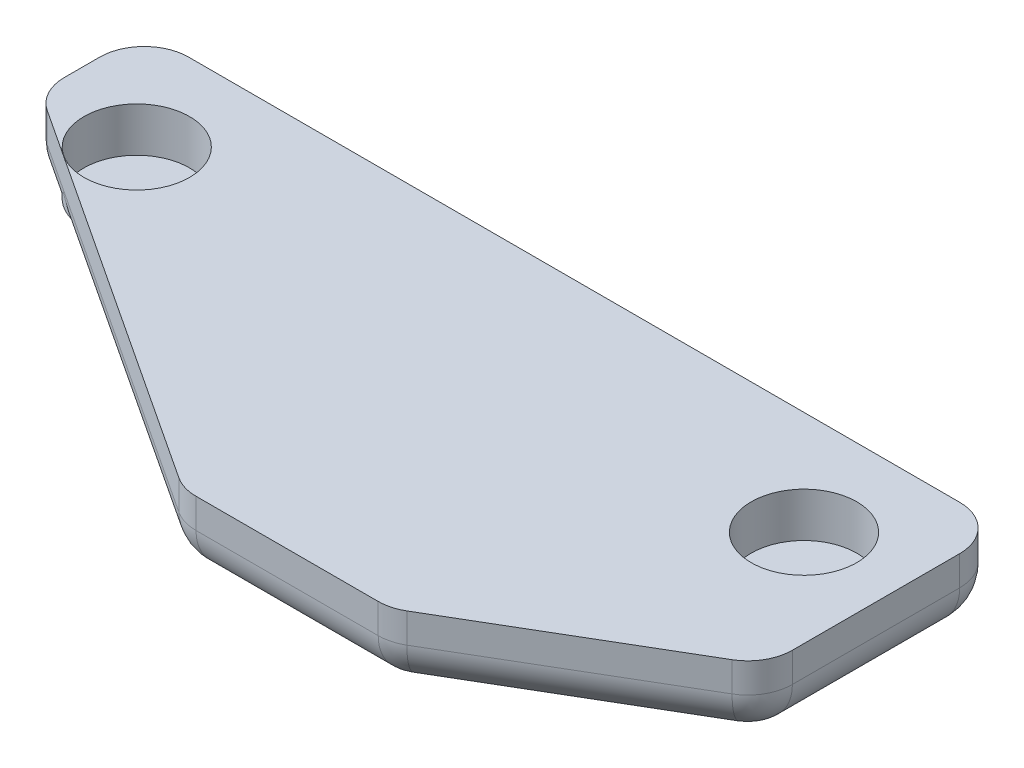
ISO-10303-21;
HEADER;
FILE_DESCRIPTION(('STEP AP214'),'2;1');
FILE_NAME('part.step','',(''),(''),'','','');
FILE_SCHEMA(('AUTOMOTIVE_DESIGN { 1 0 10303 214 1 1 1 1 }'));
ENDSEC;
DATA;
#1=APPLICATION_CONTEXT('core data for automotive mechanical design processes');
#2=APPLICATION_PROTOCOL_DEFINITION('international standard','automotive_design',2000,#1);
#3=PRODUCT_CONTEXT('',#1,'mechanical');
#4=PRODUCT('Part','Part','',(#3));
#5=PRODUCT_RELATED_PRODUCT_CATEGORY('part','',(#4));
#6=PRODUCT_DEFINITION_FORMATION('','',#4);
#7=PRODUCT_DEFINITION_CONTEXT('part definition',#1,'design');
#8=PRODUCT_DEFINITION('design','',#6,#7);
#9=PRODUCT_DEFINITION_SHAPE('','',#8);
#10=(LENGTH_UNIT() NAMED_UNIT(*) SI_UNIT(.MILLI.,.METRE.));
#11=(NAMED_UNIT(*) PLANE_ANGLE_UNIT() SI_UNIT($,.RADIAN.));
#12=(NAMED_UNIT(*) SI_UNIT($,.STERADIAN.) SOLID_ANGLE_UNIT());
#13=UNCERTAINTY_MEASURE_WITH_UNIT(LENGTH_MEASURE(1.E-05),#10,'distance_accuracy_value','');
#14=(GEOMETRIC_REPRESENTATION_CONTEXT(3) GLOBAL_UNCERTAINTY_ASSIGNED_CONTEXT((#13)) GLOBAL_UNIT_ASSIGNED_CONTEXT((#10,
#11,#12)) REPRESENTATION_CONTEXT('',''));
#15=CARTESIAN_POINT('',(0.,0.,0.));
#16=DIRECTION('',(0.,0.,1.));
#17=DIRECTION('',(1.,0.,0.));
#18=AXIS2_PLACEMENT_3D('',#15,#16,#17);
#19=CARTESIAN_POINT('',(-21.2161538362544,2.5,-11.7419034293701));
#20=DIRECTION('',(0.,0.,1.));
#21=DIRECTION('',(1.,0.,0.));
#22=AXIS2_PLACEMENT_3D('',#19,#20,#21);
#23=PLANE('',#22);
#24=DIRECTION('',(-1.,0.,0.));
#25=VECTOR('',#24,1.);
#26=CARTESIAN_POINT('',(-21.2161538362544,2.5,-11.7419034293701));
#27=LINE('',#26,#25);
#28=CARTESIAN_POINT('',(6.28384616374557,2.5,-11.7419034293701));
#29=VERTEX_POINT('',#28);
#30=CARTESIAN_POINT('',(-19.7161538362544,2.5,-11.7419034293701));
#31=VERTEX_POINT('',#30);
#32=EDGE_CURVE('E342',#29,#31,#27,.T.);
#33=ORIENTED_EDGE('',*,*,#32,.F.);
#34=DIRECTION('',(0.,-1.,0.));
#35=VECTOR('',#34,1.);
#36=CARTESIAN_POINT('',(6.28384616374558,2.5,-11.7419034293701));
#37=LINE('',#36,#35);
#38=CARTESIAN_POINT('',(6.28384616374558,1.5,-11.7419034293701));
#39=VERTEX_POINT('',#38);
#40=EDGE_CURVE('E11',#29,#39,#37,.T.);
#41=ORIENTED_EDGE('',*,*,#40,.T.);
#42=DIRECTION('',(-1.,0.,0.));
#43=VECTOR('',#42,1.);
#44=CARTESIAN_POINT('',(-21.2161538362544,1.5,-11.7419034293701));
#45=LINE('',#44,#43);
#46=CARTESIAN_POINT('',(-19.7161538362544,1.5,-11.7419034293701));
#47=VERTEX_POINT('',#46);
#48=EDGE_CURVE('E55',#39,#47,#45,.T.);
#49=ORIENTED_EDGE('',*,*,#48,.T.);
#50=DIRECTION('',(0.,-1.,0.));
#51=VECTOR('',#50,1.);
#52=CARTESIAN_POINT('',(-19.7161538362544,2.5,-11.7419034293701));
#53=LINE('',#52,#51);
#54=EDGE_CURVE('E254',#47,#31,#53,.F.);
#55=ORIENTED_EDGE('',*,*,#54,.T.);
#56=EDGE_LOOP('',(#33,#41,#49,#55));
#57=FACE_BOUND('',#56,.T.);
#58=ADVANCED_FACE('F45',(#57),#23,.F.);
#59=CARTESIAN_POINT('',(-21.2161538362544,2.5,-11.7419034293701));
#60=DIRECTION('',(1.,0.,0.));
#61=DIRECTION('',(0.,0.,-1.));
#62=AXIS2_PLACEMENT_3D('',#59,#60,#61);
#63=PLANE('',#62);
#64=DIRECTION('',(0.,0.,1.));
#65=VECTOR('',#64,1.);
#66=CARTESIAN_POINT('',(-21.2161538362544,1.5,-11.7419034293701));
#67=LINE('',#66,#65);
#68=CARTESIAN_POINT('',(-21.2161538362544,1.5,-10.2419034293701));
#69=VERTEX_POINT('',#68);
#70=CARTESIAN_POINT('',(-21.2161538362544,1.5,-9.05107985148774));
#71=VERTEX_POINT('',#70);
#72=EDGE_CURVE('E220',#69,#71,#67,.T.);
#73=ORIENTED_EDGE('',*,*,#72,.T.);
#74=DIRECTION('',(0.,-1.,0.));
#75=VECTOR('',#74,1.);
#76=CARTESIAN_POINT('',(-21.2161538362544,2.5,-9.05107985148774));
#77=LINE('',#76,#75);
#78=CARTESIAN_POINT('',(-21.2161538362544,2.5,-9.05107985148774));
#79=VERTEX_POINT('',#78);
#80=EDGE_CURVE('E223',#71,#79,#77,.F.);
#81=ORIENTED_EDGE('',*,*,#80,.T.);
#82=DIRECTION('',(0.,0.,1.));
#83=VECTOR('',#82,1.);
#84=CARTESIAN_POINT('',(-21.2161538362544,2.5,-11.7419034293701));
#85=LINE('',#84,#83);
#86=CARTESIAN_POINT('',(-21.2161538362544,2.5,-10.2419034293701));
#87=VERTEX_POINT('',#86);
#88=EDGE_CURVE('E346',#87,#79,#85,.T.);
#89=ORIENTED_EDGE('',*,*,#88,.F.);
#90=DIRECTION('',(0.,-1.,0.));
#91=VECTOR('',#90,1.);
#92=CARTESIAN_POINT('',(-21.2161538362544,2.5,-10.2419034293701));
#93=LINE('',#92,#91);
#94=EDGE_CURVE('E217',#87,#69,#93,.T.);
#95=ORIENTED_EDGE('',*,*,#94,.T.);
#96=EDGE_LOOP('',(#73,#81,#89,#95));
#97=FACE_BOUND('',#96,.T.);
#98=ADVANCED_FACE('F390',(#97),#63,.F.);
#99=CARTESIAN_POINT('',(-21.2161538362544,2.5,-8.24190342937014));
#100=DIRECTION('',(0.549177886660837,0.,-0.835705479701274));
#101=DIRECTION('',(-0.835705479701274,0.,-0.549177886660837));
#102=AXIS2_PLACEMENT_3D('',#99,#100,#101);
#103=PLANE('',#102);
#104=DIRECTION('',(0.835705479701274,0.,0.549177886660837));
#105=VECTOR('',#104,1.);
#106=CARTESIAN_POINT('',(-21.2161538362544,1.5,-8.24190342937014));
#107=LINE('',#106,#105);
#108=CARTESIAN_POINT('',(-20.5399206662457,1.5,-7.79752163193583));
#109=VERTEX_POINT('',#108);
#110=CARTESIAN_POINT('',(-7.59117393693629,1.5,0.711654790181765));
#111=VERTEX_POINT('',#110);
#112=EDGE_CURVE('E211',#109,#111,#107,.T.);
#113=ORIENTED_EDGE('',*,*,#112,.T.);
#114=DIRECTION('',(0.,-1.,0.));
#115=VECTOR('',#114,1.);
#116=CARTESIAN_POINT('',(-7.59117393693629,2.5,0.711654790181766));
#117=LINE('',#116,#115);
#118=CARTESIAN_POINT('',(-7.59117393693629,2.5,0.711654790181766));
#119=VERTEX_POINT('',#118);
#120=EDGE_CURVE('E214',#111,#119,#117,.F.);
#121=ORIENTED_EDGE('',*,*,#120,.T.);
#122=DIRECTION('',(0.835705479701274,0.,0.549177886660837));
#123=VECTOR('',#122,1.);
#124=CARTESIAN_POINT('',(-21.2161538362544,2.5,-8.24190342937014));
#125=LINE('',#124,#123);
#126=CARTESIAN_POINT('',(-20.5399206662457,2.5,-7.79752163193583));
#127=VERTEX_POINT('',#126);
#128=EDGE_CURVE('E351',#127,#119,#125,.T.);
#129=ORIENTED_EDGE('',*,*,#128,.F.);
#130=DIRECTION('',(0.,-1.,0.));
#131=VECTOR('',#130,1.);
#132=CARTESIAN_POINT('',(-20.5399206662457,2.5,-7.79752163193583));
#133=LINE('',#132,#131);
#134=EDGE_CURVE('E163',#127,#109,#133,.T.);
#135=ORIENTED_EDGE('',*,*,#134,.T.);
#136=EDGE_LOOP('',(#113,#121,#129,#135));
#137=FACE_BOUND('',#136,.T.);
#138=ADVANCED_FACE('F395',(#137),#103,.F.);
#139=CARTESIAN_POINT('',(-7.21615383625441,2.5,0.958096570629853));
#140=DIRECTION('',(0.,0.,-1.));
#141=DIRECTION('',(-1.,0.,0.));
#142=AXIS2_PLACEMENT_3D('',#139,#140,#141);
#143=PLANE('',#142);
#144=DIRECTION('',(1.,0.,0.));
#145=VECTOR('',#144,1.);
#146=CARTESIAN_POINT('',(-7.21615383625441,1.5,0.958096570629853));
#147=LINE('',#146,#145);
#148=CARTESIAN_POINT('',(-6.76740710694503,1.5,0.958096570629853));
#149=VERTEX_POINT('',#148);
#150=CARTESIAN_POINT('',(-0.624176081385551,1.5,0.958096570629853));
#151=VERTEX_POINT('',#150);
#152=EDGE_CURVE('E180',#149,#151,#147,.T.);
#153=ORIENTED_EDGE('',*,*,#152,.T.);
#154=DIRECTION('',(0.,-1.,0.));
#155=VECTOR('',#154,1.);
#156=CARTESIAN_POINT('',(-0.624176081385552,2.5,0.958096570629853));
#157=LINE('',#156,#155);
#158=CARTESIAN_POINT('',(-0.624176081385552,2.5,0.958096570629853));
#159=VERTEX_POINT('',#158);
#160=EDGE_CURVE('E192',#151,#159,#157,.F.);
#161=ORIENTED_EDGE('',*,*,#160,.T.);
#162=DIRECTION('',(1.,0.,0.));
#163=VECTOR('',#162,1.);
#164=CARTESIAN_POINT('',(-7.21615383625441,2.5,0.958096570629853));
#165=LINE('',#164,#163);
#166=CARTESIAN_POINT('',(-6.76740710694503,2.5,0.958096570629853));
#167=VERTEX_POINT('',#166);
#168=EDGE_CURVE('E158',#167,#159,#165,.T.);
#169=ORIENTED_EDGE('',*,*,#168,.F.);
#170=DIRECTION('',(0.,-1.,0.));
#171=VECTOR('',#170,1.);
#172=CARTESIAN_POINT('',(-6.76740710694503,2.5,0.958096570629853));
#173=LINE('',#172,#171);
#174=EDGE_CURVE('E185',#167,#149,#173,.T.);
#175=ORIENTED_EDGE('',*,*,#174,.T.);
#176=EDGE_LOOP('',(#153,#161,#169,#175));
#177=FACE_BOUND('',#176,.T.);
#178=ADVANCED_FACE('F491',(#177),#143,.F.);
#179=CARTESIAN_POINT('',(-0.216153836254414,2.5,0.958096570629853));
#180=DIRECTION('',(-0.506549048630866,0.,-0.862211146605729));
#181=DIRECTION('',(-0.862211146605729,0.,0.506549048630866));
#182=AXIS2_PLACEMENT_3D('',#179,#180,#181);
#183=PLANE('',#182);
#184=DIRECTION('',(0.862211146605728,0.,-0.506549048630866));
#185=VECTOR('',#184,1.);
#186=CARTESIAN_POINT('',(-0.216153836254414,2.5,0.958096570629853));
#187=LINE('',#186,#185);
#188=CARTESIAN_POINT('',(0.135647491560747,2.5,0.751413290538446));
#189=VERTEX_POINT('',#188);
#190=CARTESIAN_POINT('',(7.04366973669188,2.5,-3.3070497784761));
#191=VERTEX_POINT('',#190);
#192=EDGE_CURVE('E155',#189,#191,#187,.T.);
#193=ORIENTED_EDGE('',*,*,#192,.F.);
#194=DIRECTION('',(0.,-1.,0.));
#195=VECTOR('',#194,1.);
#196=CARTESIAN_POINT('',(0.135647491560747,2.5,0.751413290538446));
#197=LINE('',#196,#195);
#198=CARTESIAN_POINT('',(0.135647491560747,1.5,0.751413290538446));
#199=VERTEX_POINT('',#198);
#200=EDGE_CURVE('E169',#189,#199,#197,.T.);
#201=ORIENTED_EDGE('',*,*,#200,.T.);
#202=DIRECTION('',(0.862211146605729,0.,-0.506549048630866));
#203=VECTOR('',#202,1.);
#204=CARTESIAN_POINT('',(-0.216153836254414,1.5,0.958096570629853));
#205=LINE('',#204,#203);
#206=CARTESIAN_POINT('',(7.04366973669188,1.5,-3.3070497784761));
#207=VERTEX_POINT('',#206);
#208=EDGE_CURVE('E181',#199,#207,#205,.T.);
#209=ORIENTED_EDGE('',*,*,#208,.T.);
#210=DIRECTION('',(0.,-1.,0.));
#211=VECTOR('',#210,1.);
#212=CARTESIAN_POINT('',(7.04366973669188,2.5,-3.3070497784761));
#213=LINE('',#212,#211);
#214=EDGE_CURVE('E171',#207,#191,#213,.F.);
#215=ORIENTED_EDGE('',*,*,#214,.T.);
#216=EDGE_LOOP('',(#193,#201,#209,#215));
#217=FACE_BOUND('',#216,.T.);
#218=ADVANCED_FACE('F168',(#217),#183,.F.);
#219=CARTESIAN_POINT('',(7.78384616374558,2.5,-3.74190342937014));
#220=DIRECTION('',(-1.,0.,0.));
#221=DIRECTION('',(0.,0.,1.));
#222=AXIS2_PLACEMENT_3D('',#219,#220,#221);
#223=PLANE('',#222);
#224=DIRECTION('',(0.,0.,-1.));
#225=VECTOR('',#224,1.);
#226=CARTESIAN_POINT('',(7.78384616374558,2.5,-3.74190342937014));
#227=LINE('',#226,#225);
#228=CARTESIAN_POINT('',(7.78384616374558,2.5,-4.60036649838469));
#229=VERTEX_POINT('',#228);
#230=CARTESIAN_POINT('',(7.78384616374558,2.5,-10.2419034293701));
#231=VERTEX_POINT('',#230);
#232=EDGE_CURVE('E173',#229,#231,#227,.T.);
#233=ORIENTED_EDGE('',*,*,#232,.F.);
#234=DIRECTION('',(0.,-1.,0.));
#235=VECTOR('',#234,1.);
#236=CARTESIAN_POINT('',(7.78384616374558,2.5,-4.60036649838469));
#237=LINE('',#236,#235);
#238=CARTESIAN_POINT('',(7.78384616374558,1.5,-4.60036649838469));
#239=VERTEX_POINT('',#238);
#240=EDGE_CURVE('E251',#229,#239,#237,.T.);
#241=ORIENTED_EDGE('',*,*,#240,.T.);
#242=DIRECTION('',(0.,0.,-1.));
#243=VECTOR('',#242,1.);
#244=CARTESIAN_POINT('',(7.78384616374558,1.5,-3.74190342937014));
#245=LINE('',#244,#243);
#246=CARTESIAN_POINT('',(7.78384616374558,1.5,-10.2419034293701));
#247=VERTEX_POINT('',#246);
#248=EDGE_CURVE('E248',#239,#247,#245,.T.);
#249=ORIENTED_EDGE('',*,*,#248,.T.);
#250=DIRECTION('',(0.,-1.,0.));
#251=VECTOR('',#250,1.);
#252=CARTESIAN_POINT('',(7.78384616374558,2.5,-10.2419034293701));
#253=LINE('',#252,#251);
#254=EDGE_CURVE('E245',#247,#231,#253,.F.);
#255=ORIENTED_EDGE('',*,*,#254,.T.);
#256=EDGE_LOOP('',(#233,#241,#249,#255));
#257=FACE_BOUND('',#256,.T.);
#258=ADVANCED_FACE('F372',(#257),#223,.F.);
#259=CARTESIAN_POINT('',(0.,2.5,0.));
#260=DIRECTION('',(0.,1.,0.));
#261=DIRECTION('',(0.,0.,1.));
#262=AXIS2_PLACEMENT_3D('',#259,#260,#261);
#263=PLANE('',#262);
#264=CARTESIAN_POINT('',(-17.9661538362544,2.5,-8.24190342937014));
#265=DIRECTION('',(0.,1.,0.));
#266=DIRECTION('',(0.,0.,1.));
#267=AXIS2_PLACEMENT_3D('',#264,#265,#266);
#268=CIRCLE('',#267,1.78);
#269=CARTESIAN_POINT('',(-17.9661538362544,2.5,-6.46190342937014));
#270=VERTEX_POINT('',#269);
#271=EDGE_CURVE('E338',#270,#270,#268,.T.);
#272=ORIENTED_EDGE('',*,*,#271,.F.);
#273=EDGE_LOOP('',(#272));
#274=FACE_BOUND('',#273,.T.);
#275=CARTESIAN_POINT('',(4.53384616374558,2.5,-8.24190342937014));
#276=DIRECTION('',(0.,1.,0.));
#277=DIRECTION('',(0.,0.,-1.));
#278=AXIS2_PLACEMENT_3D('',#275,#276,#277);
#279=CIRCLE('',#278,1.78);
#280=CARTESIAN_POINT('',(4.53384616374558,2.5,-10.0219034293701));
#281=VERTEX_POINT('',#280);
#282=EDGE_CURVE('E332',#281,#281,#279,.T.);
#283=ORIENTED_EDGE('',*,*,#282,.F.);
#284=EDGE_LOOP('',(#283));
#285=FACE_BOUND('',#284,.T.);
#286=ORIENTED_EDGE('',*,*,#168,.T.);
#287=CARTESIAN_POINT('',(-0.624176081385551,2.5,-0.541903429370147));
#288=DIRECTION('',(0.,1.,0.));
#289=DIRECTION('',(0.,0.,1.));
#290=AXIS2_PLACEMENT_3D('',#287,#288,#289);
#291=CIRCLE('',#290,1.5);
#292=EDGE_CURVE('E152',#159,#189,#291,.T.);
#293=ORIENTED_EDGE('',*,*,#292,.T.);
#294=ORIENTED_EDGE('',*,*,#192,.T.);
#295=CARTESIAN_POINT('',(6.28384616374558,2.5,-4.60036649838469));
#296=DIRECTION('',(0.,1.,0.));
#297=DIRECTION('',(0.,0.,1.));
#298=AXIS2_PLACEMENT_3D('',#295,#296,#297);
#299=CIRCLE('',#298,1.5);
#300=EDGE_CURVE('E204',#191,#229,#299,.T.);
#301=ORIENTED_EDGE('',*,*,#300,.T.);
#302=ORIENTED_EDGE('',*,*,#232,.T.);
#303=CARTESIAN_POINT('',(6.28384616374558,2.5,-10.2419034293701));
#304=DIRECTION('',(0.,1.,0.));
#305=DIRECTION('',(0.,0.,1.));
#306=AXIS2_PLACEMENT_3D('',#303,#304,#305);
#307=CIRCLE('',#306,1.5);
#308=EDGE_CURVE('E201',#231,#29,#307,.T.);
#309=ORIENTED_EDGE('',*,*,#308,.T.);
#310=ORIENTED_EDGE('',*,*,#32,.T.);
#311=CARTESIAN_POINT('',(-19.7161538362544,2.5,-10.2419034293701));
#312=DIRECTION('',(0.,1.,0.));
#313=DIRECTION('',(0.,0.,1.));
#314=AXIS2_PLACEMENT_3D('',#311,#312,#313);
#315=CIRCLE('',#314,1.5);
#316=EDGE_CURVE('E195',#31,#87,#315,.T.);
#317=ORIENTED_EDGE('',*,*,#316,.T.);
#318=ORIENTED_EDGE('',*,*,#88,.T.);
#319=CARTESIAN_POINT('',(-19.7161538362544,2.5,-9.05107985148774));
#320=DIRECTION('',(0.,1.,0.));
#321=DIRECTION('',(0.,0.,1.));
#322=AXIS2_PLACEMENT_3D('',#319,#320,#321);
#323=CIRCLE('',#322,1.5);
#324=EDGE_CURVE('E198',#79,#127,#323,.T.);
#325=ORIENTED_EDGE('',*,*,#324,.T.);
#326=ORIENTED_EDGE('',*,*,#128,.T.);
#327=CARTESIAN_POINT('',(-6.76740710694503,2.5,-0.541903429370147));
#328=DIRECTION('',(0.,1.,0.));
#329=DIRECTION('',(0.,0.,1.));
#330=AXIS2_PLACEMENT_3D('',#327,#328,#329);
#331=CIRCLE('',#330,1.5);
#332=EDGE_CURVE('E164',#119,#167,#331,.T.);
#333=ORIENTED_EDGE('',*,*,#332,.T.);
#334=EDGE_LOOP('',(#286,#293,#294,#301,#302,#309,#310,#317,#318,#325,#326,#333));
#335=FACE_BOUND('',#334,.T.);
#336=ADVANCED_FACE('F154',(#274,#285,#335),#263,.T.);
#337=CARTESIAN_POINT('',(0.,0.,0.));
#338=DIRECTION('',(0.,1.,0.));
#339=DIRECTION('',(0.,0.,1.));
#340=AXIS2_PLACEMENT_3D('',#337,#338,#339);
#341=PLANE('',#340);
#342=DIRECTION('',(0.835705479701274,0.,0.549177886660837));
#343=VECTOR('',#342,1.);
#344=CARTESIAN_POINT('',(-1.79231818639165,0.,2.72744071842207));
#345=LINE('',#344,#343);
#346=CARTESIAN_POINT('',(-6.76740710694503,0.,-0.541903429370147));
#347=VERTEX_POINT('',#346);
#348=CARTESIAN_POINT('',(-19.7161538362544,0.,-9.05107985148774));
#349=VERTEX_POINT('',#348);
#350=EDGE_CURVE('E238',#347,#349,#345,.F.);
#351=ORIENTED_EDGE('',*,*,#350,.T.);
#352=DIRECTION('',(0.,0.,1.));
#353=VECTOR('',#352,1.);
#354=CARTESIAN_POINT('',(-19.7161538362544,0.,0.));
#355=LINE('',#354,#353);
#356=CARTESIAN_POINT('',(-19.7161538362544,0.,-10.2419034293701));
#357=VERTEX_POINT('',#356);
#358=EDGE_CURVE('E241',#349,#357,#355,.F.);
#359=ORIENTED_EDGE('',*,*,#358,.T.);
#360=DIRECTION('',(-1.,0.,0.));
#361=VECTOR('',#360,1.);
#362=CARTESIAN_POINT('',(0.,0.,-10.2419034293701));
#363=LINE('',#362,#361);
#364=CARTESIAN_POINT('',(6.28384616374558,0.,-10.2419034293701));
#365=VERTEX_POINT('',#364);
#366=EDGE_CURVE('E226',#357,#365,#363,.F.);
#367=ORIENTED_EDGE('',*,*,#366,.T.);
#368=DIRECTION('',(0.,0.,-1.));
#369=VECTOR('',#368,1.);
#370=CARTESIAN_POINT('',(6.28384616374558,0.,0.));
#371=LINE('',#370,#369);
#372=CARTESIAN_POINT('',(6.28384616374558,0.,-4.60036649838469));
#373=VERTEX_POINT('',#372);
#374=EDGE_CURVE('E229',#365,#373,#371,.F.);
#375=ORIENTED_EDGE('',*,*,#374,.T.);
#376=DIRECTION('',(0.862211146605729,0.,-0.506549048630866));
#377=VECTOR('',#376,1.);
#378=CARTESIAN_POINT('',(-0.396836085284288,0.,-0.675465677079639));
#379=LINE('',#378,#377);
#380=CARTESIAN_POINT('',(-0.624176081385551,0.,-0.541903429370147));
#381=VERTEX_POINT('',#380);
#382=EDGE_CURVE('E232',#373,#381,#379,.F.);
#383=ORIENTED_EDGE('',*,*,#382,.T.);
#384=DIRECTION('',(1.,0.,0.));
#385=VECTOR('',#384,1.);
#386=CARTESIAN_POINT('',(0.,0.,-0.541903429370147));
#387=LINE('',#386,#385);
#388=EDGE_CURVE('E235',#381,#347,#387,.F.);
#389=ORIENTED_EDGE('',*,*,#388,.T.);
#390=EDGE_LOOP('',(#351,#359,#367,#375,#383,#389));
#391=FACE_BOUND('',#390,.T.);
#392=ADVANCED_FACE('F371',(#391),#341,.F.);
#393=CARTESIAN_POINT('',(4.53384616374558,1.,-8.24190342937014));
#394=DIRECTION('',(0.,1.,0.));
#395=DIRECTION('',(0.,0.,1.));
#396=AXIS2_PLACEMENT_3D('',#393,#394,#395);
#397=CYLINDRICAL_SURFACE('',#396,1.78);
#398=CARTESIAN_POINT('',(4.53384616374558,1.,-8.24190342937014));
#399=DIRECTION('',(0.,1.,0.));
#400=DIRECTION('',(0.,0.,-1.));
#401=AXIS2_PLACEMENT_3D('',#398,#399,#400);
#402=CIRCLE('',#401,1.78);
#403=CARTESIAN_POINT('',(4.53384616374558,1.,-10.0219034293701));
#404=VERTEX_POINT('',#403);
#405=EDGE_CURVE('E326',#404,#404,#402,.T.);
#406=ORIENTED_EDGE('',*,*,#405,.F.);
#407=EDGE_LOOP('',(#406));
#408=FACE_BOUND('',#407,.T.);
#409=ORIENTED_EDGE('',*,*,#282,.T.);
#410=EDGE_LOOP('',(#409));
#411=FACE_BOUND('',#410,.T.);
#412=ADVANCED_FACE('F376',(#408,#411),#397,.F.);
#413=CARTESIAN_POINT('',(4.53384616374558,1.,-8.24190342937014));
#414=DIRECTION('',(0.,-1.,0.));
#415=DIRECTION('',(0.,0.,-1.));
#416=AXIS2_PLACEMENT_3D('',#413,#414,#415);
#417=PLANE('',#416);
#418=ORIENTED_EDGE('',*,*,#405,.T.);
#419=EDGE_LOOP('',(#418));
#420=FACE_BOUND('',#419,.T.);
#421=ADVANCED_FACE('F378',(#420),#417,.F.);
#422=CARTESIAN_POINT('',(-17.9661538362544,1.,-8.24190342937014));
#423=DIRECTION('',(0.,1.,0.));
#424=DIRECTION('',(0.,0.,1.));
#425=AXIS2_PLACEMENT_3D('',#422,#423,#424);
#426=CYLINDRICAL_SURFACE('',#425,1.78);
#427=CARTESIAN_POINT('',(-17.9661538362544,1.,-8.24190342937014));
#428=DIRECTION('',(0.,1.,0.));
#429=DIRECTION('',(0.,0.,1.));
#430=AXIS2_PLACEMENT_3D('',#427,#428,#429);
#431=CIRCLE('',#430,1.78);
#432=CARTESIAN_POINT('',(-17.9661538362544,1.,-6.46190342937014));
#433=VERTEX_POINT('',#432);
#434=EDGE_CURVE('E347',#433,#433,#431,.T.);
#435=ORIENTED_EDGE('',*,*,#434,.F.);
#436=EDGE_LOOP('',(#435));
#437=FACE_BOUND('',#436,.T.);
#438=ORIENTED_EDGE('',*,*,#271,.T.);
#439=EDGE_LOOP('',(#438));
#440=FACE_BOUND('',#439,.T.);
#441=ADVANCED_FACE('F367',(#437,#440),#426,.F.);
#442=CARTESIAN_POINT('',(-17.9661538362544,1.,-8.24190342937014));
#443=DIRECTION('',(0.,1.,0.));
#444=DIRECTION('',(0.,0.,1.));
#445=AXIS2_PLACEMENT_3D('',#442,#443,#444);
#446=PLANE('',#445);
#447=ORIENTED_EDGE('',*,*,#434,.T.);
#448=EDGE_LOOP('',(#447));
#449=FACE_BOUND('',#448,.T.);
#450=ADVANCED_FACE('F465',(#449),#446,.T.);
#451=CARTESIAN_POINT('',(-19.7161538362544,2.5,-10.2419034293701));
#452=DIRECTION('',(0.,-1.,0.));
#453=DIRECTION('',(0.,0.,-1.));
#454=AXIS2_PLACEMENT_3D('',#451,#452,#453);
#455=CYLINDRICAL_SURFACE('',#454,1.5);
#456=CARTESIAN_POINT('',(-19.7161538362544,1.5,-10.2419034293701));
#457=DIRECTION('',(0.,-1.,0.));
#458=DIRECTION('',(0.,0.,-1.));
#459=AXIS2_PLACEMENT_3D('',#456,#457,#458);
#460=CIRCLE('',#459,1.5);
#461=EDGE_CURVE('E49',#69,#47,#460,.T.);
#462=ORIENTED_EDGE('',*,*,#461,.F.);
#463=ORIENTED_EDGE('',*,*,#94,.F.);
#464=ORIENTED_EDGE('',*,*,#316,.F.);
#465=ORIENTED_EDGE('',*,*,#54,.F.);
#466=EDGE_LOOP('',(#462,#463,#464,#465));
#467=FACE_BOUND('',#466,.T.);
#468=ADVANCED_FACE('F47',(#467),#455,.T.);
#469=CARTESIAN_POINT('',(-19.7161538362544,1.5,-10.2419034293701));
#470=DIRECTION('',(0.,0.,-1.));
#471=DIRECTION('',(-1.,0.,0.));
#472=AXIS2_PLACEMENT_3D('',#469,#470,#471);
#473=SPHERICAL_SURFACE('',#472,1.5);
#474=CARTESIAN_POINT('',(-19.7161538362544,1.5,-10.2419034293701));
#475=DIRECTION('',(0.,0.,-1.));
#476=DIRECTION('',(-1.,0.,0.));
#477=AXIS2_PLACEMENT_3D('',#474,#475,#476);
#478=CIRCLE('',#477,1.5);
#479=EDGE_CURVE('E316',#69,#357,#478,.F.);
#480=ORIENTED_EDGE('',*,*,#479,.F.);
#481=ORIENTED_EDGE('',*,*,#461,.T.);
#482=CARTESIAN_POINT('',(-19.7161538362544,1.5,-10.2419034293701));
#483=DIRECTION('',(-1.,0.,0.));
#484=DIRECTION('',(0.,0.,1.));
#485=AXIS2_PLACEMENT_3D('',#482,#483,#484);
#486=CIRCLE('',#485,1.5);
#487=EDGE_CURVE('E319',#357,#47,#486,.F.);
#488=ORIENTED_EDGE('',*,*,#487,.F.);
#489=EDGE_LOOP('',(#480,#481,#488));
#490=FACE_BOUND('',#489,.T.);
#491=ADVANCED_FACE('F459',(#490),#473,.T.);
#492=CARTESIAN_POINT('',(6.28384616374558,2.5,-10.2419034293701));
#493=DIRECTION('',(0.,-1.,0.));
#494=DIRECTION('',(0.,0.,-1.));
#495=AXIS2_PLACEMENT_3D('',#492,#493,#494);
#496=CYLINDRICAL_SURFACE('',#495,1.5);
#497=ORIENTED_EDGE('',*,*,#308,.F.);
#498=ORIENTED_EDGE('',*,*,#254,.F.);
#499=CARTESIAN_POINT('',(6.28384616374558,1.5,-10.2419034293701));
#500=DIRECTION('',(0.,-1.,0.));
#501=DIRECTION('',(0.,0.,-1.));
#502=AXIS2_PLACEMENT_3D('',#499,#500,#501);
#503=CIRCLE('',#502,1.5);
#504=EDGE_CURVE('E312',#39,#247,#503,.T.);
#505=ORIENTED_EDGE('',*,*,#504,.F.);
#506=ORIENTED_EDGE('',*,*,#40,.F.);
#507=EDGE_LOOP('',(#497,#498,#505,#506));
#508=FACE_BOUND('',#507,.T.);
#509=ADVANCED_FACE('F457',(#508),#496,.T.);
#510=CARTESIAN_POINT('',(-21.2161538362544,1.5,-10.2419034293701));
#511=DIRECTION('',(-1.,0.,0.));
#512=DIRECTION('',(0.,0.,1.));
#513=AXIS2_PLACEMENT_3D('',#510,#511,#512);
#514=CYLINDRICAL_SURFACE('',#513,1.5);
#515=ORIENTED_EDGE('',*,*,#487,.T.);
#516=ORIENTED_EDGE('',*,*,#48,.F.);
#517=CARTESIAN_POINT('',(6.28384616374558,1.5,-10.2419034293701));
#518=DIRECTION('',(1.,0.,0.));
#519=DIRECTION('',(0.,0.,-1.));
#520=AXIS2_PLACEMENT_3D('',#517,#518,#519);
#521=CIRCLE('',#520,1.5);
#522=EDGE_CURVE('E308',#365,#39,#521,.T.);
#523=ORIENTED_EDGE('',*,*,#522,.F.);
#524=ORIENTED_EDGE('',*,*,#366,.F.);
#525=EDGE_LOOP('',(#515,#516,#523,#524));
#526=FACE_BOUND('',#525,.T.);
#527=ADVANCED_FACE('F453',(#526),#514,.T.);
#528=CARTESIAN_POINT('',(-19.7161538362544,1.5,-11.7419034293701));
#529=DIRECTION('',(0.,0.,1.));
#530=DIRECTION('',(1.,0.,0.));
#531=AXIS2_PLACEMENT_3D('',#528,#529,#530);
#532=CYLINDRICAL_SURFACE('',#531,1.5);
#533=ORIENTED_EDGE('',*,*,#479,.T.);
#534=ORIENTED_EDGE('',*,*,#358,.F.);
#535=CARTESIAN_POINT('',(-19.7161538362544,1.5,-9.05107985148774));
#536=DIRECTION('',(0.,0.,1.));
#537=DIRECTION('',(1.,0.,0.));
#538=AXIS2_PLACEMENT_3D('',#535,#536,#537);
#539=CIRCLE('',#538,1.5);
#540=EDGE_CURVE('E304',#71,#349,#539,.T.);
#541=ORIENTED_EDGE('',*,*,#540,.F.);
#542=ORIENTED_EDGE('',*,*,#72,.F.);
#543=EDGE_LOOP('',(#533,#534,#541,#542));
#544=FACE_BOUND('',#543,.T.);
#545=ADVANCED_FACE('F449',(#544),#532,.T.);
#546=CARTESIAN_POINT('',(-19.7161538362544,2.5,-9.05107985148774));
#547=DIRECTION('',(0.,-1.,0.));
#548=DIRECTION('',(0.,0.,-1.));
#549=AXIS2_PLACEMENT_3D('',#546,#547,#548);
#550=CYLINDRICAL_SURFACE('',#549,1.5);
#551=ORIENTED_EDGE('',*,*,#324,.F.);
#552=ORIENTED_EDGE('',*,*,#80,.F.);
#553=CARTESIAN_POINT('',(-19.7161538362544,1.5,-9.05107985148774));
#554=DIRECTION('',(0.,-1.,0.));
#555=DIRECTION('',(0.,0.,-1.));
#556=AXIS2_PLACEMENT_3D('',#553,#554,#555);
#557=CIRCLE('',#556,1.5);
#558=EDGE_CURVE('E300',#109,#71,#557,.T.);
#559=ORIENTED_EDGE('',*,*,#558,.F.);
#560=ORIENTED_EDGE('',*,*,#134,.F.);
#561=EDGE_LOOP('',(#551,#552,#559,#560));
#562=FACE_BOUND('',#561,.T.);
#563=ADVANCED_FACE('F445',(#562),#550,.T.);
#564=CARTESIAN_POINT('',(6.28384616374558,1.5,-10.2419034293701));
#565=DIRECTION('',(0.,0.,-1.));
#566=DIRECTION('',(-1.,0.,0.));
#567=AXIS2_PLACEMENT_3D('',#564,#565,#566);
#568=SPHERICAL_SURFACE('',#567,1.5);
#569=ORIENTED_EDGE('',*,*,#522,.T.);
#570=ORIENTED_EDGE('',*,*,#504,.T.);
#571=CARTESIAN_POINT('',(6.28384616374558,1.5,-10.2419034293701));
#572=DIRECTION('',(0.,0.,-1.));
#573=DIRECTION('',(-1.,0.,0.));
#574=AXIS2_PLACEMENT_3D('',#571,#572,#573);
#575=CIRCLE('',#574,1.5);
#576=EDGE_CURVE('E296',#365,#247,#575,.F.);
#577=ORIENTED_EDGE('',*,*,#576,.F.);
#578=EDGE_LOOP('',(#569,#570,#577));
#579=FACE_BOUND('',#578,.T.);
#580=ADVANCED_FACE('F441',(#579),#568,.T.);
#581=CARTESIAN_POINT('',(-19.7161538362544,1.5,-9.05107985148774));
#582=DIRECTION('',(0.,-1.,0.));
#583=DIRECTION('',(0.,0.,-1.));
#584=AXIS2_PLACEMENT_3D('',#581,#582,#583);
#585=SPHERICAL_SURFACE('',#584,1.5);
#586=ORIENTED_EDGE('',*,*,#558,.T.);
#587=ORIENTED_EDGE('',*,*,#540,.T.);
#588=CARTESIAN_POINT('',(-19.7161538362544,1.5,-9.05107985148774));
#589=DIRECTION('',(-0.835705479701274,0.,-0.549177886660837));
#590=DIRECTION('',(-0.549177886660837,0.,0.835705479701274));
#591=AXIS2_PLACEMENT_3D('',#588,#589,#590);
#592=CIRCLE('',#591,1.5);
#593=EDGE_CURVE('E292',#109,#349,#592,.F.);
#594=ORIENTED_EDGE('',*,*,#593,.F.);
#595=EDGE_LOOP('',(#586,#587,#594));
#596=FACE_BOUND('',#595,.T.);
#597=ADVANCED_FACE('F437',(#596),#585,.T.);
#598=CARTESIAN_POINT('',(6.28384616374558,2.5,-4.60036649838469));
#599=DIRECTION('',(0.,-1.,0.));
#600=DIRECTION('',(0.,0.,-1.));
#601=AXIS2_PLACEMENT_3D('',#598,#599,#600);
#602=CYLINDRICAL_SURFACE('',#601,1.5);
#603=ORIENTED_EDGE('',*,*,#300,.F.);
#604=ORIENTED_EDGE('',*,*,#214,.F.);
#605=CARTESIAN_POINT('',(6.28384616374558,1.5,-4.60036649838469));
#606=DIRECTION('',(0.,-1.,0.));
#607=DIRECTION('',(0.,0.,-1.));
#608=AXIS2_PLACEMENT_3D('',#605,#606,#607);
#609=CIRCLE('',#608,1.5);
#610=EDGE_CURVE('E288',#239,#207,#609,.T.);
#611=ORIENTED_EDGE('',*,*,#610,.F.);
#612=ORIENTED_EDGE('',*,*,#240,.F.);
#613=EDGE_LOOP('',(#603,#604,#611,#612));
#614=FACE_BOUND('',#613,.T.);
#615=ADVANCED_FACE('F433',(#614),#602,.T.);
#616=CARTESIAN_POINT('',(6.28384616374558,1.5,-3.74190342937014));
#617=DIRECTION('',(0.,0.,-1.));
#618=DIRECTION('',(-1.,0.,0.));
#619=AXIS2_PLACEMENT_3D('',#616,#617,#618);
#620=CYLINDRICAL_SURFACE('',#619,1.5);
#621=ORIENTED_EDGE('',*,*,#576,.T.);
#622=ORIENTED_EDGE('',*,*,#248,.F.);
#623=CARTESIAN_POINT('',(6.28384616374558,1.5,-4.60036649838469));
#624=DIRECTION('',(0.,0.,1.));
#625=DIRECTION('',(1.,0.,0.));
#626=AXIS2_PLACEMENT_3D('',#623,#624,#625);
#627=CIRCLE('',#626,1.5);
#628=EDGE_CURVE('E284',#373,#239,#627,.T.);
#629=ORIENTED_EDGE('',*,*,#628,.F.);
#630=ORIENTED_EDGE('',*,*,#374,.F.);
#631=EDGE_LOOP('',(#621,#622,#629,#630));
#632=FACE_BOUND('',#631,.T.);
#633=ADVANCED_FACE('F429',(#632),#620,.T.);
#634=CARTESIAN_POINT('',(-20.3923870062632,1.5,-9.49546164892205));
#635=DIRECTION('',(0.835705479701274,0.,0.549177886660837));
#636=DIRECTION('',(0.549177886660837,0.,-0.835705479701274));
#637=AXIS2_PLACEMENT_3D('',#634,#635,#636);
#638=CYLINDRICAL_SURFACE('',#637,1.5);
#639=ORIENTED_EDGE('',*,*,#593,.T.);
#640=ORIENTED_EDGE('',*,*,#350,.F.);
#641=CARTESIAN_POINT('',(-6.76740710694503,1.5,-0.541903429370146));
#642=DIRECTION('',(0.835705479701274,0.,0.549177886660837));
#643=DIRECTION('',(0.549177886660837,0.,-0.835705479701274));
#644=AXIS2_PLACEMENT_3D('',#641,#642,#643);
#645=CIRCLE('',#644,1.5);
#646=EDGE_CURVE('E280',#111,#347,#645,.T.);
#647=ORIENTED_EDGE('',*,*,#646,.F.);
#648=ORIENTED_EDGE('',*,*,#112,.F.);
#649=EDGE_LOOP('',(#639,#640,#647,#648));
#650=FACE_BOUND('',#649,.T.);
#651=ADVANCED_FACE('F425',(#650),#638,.T.);
#652=CARTESIAN_POINT('',(-6.76740710694503,2.5,-0.541903429370147));
#653=DIRECTION('',(0.,-1.,0.));
#654=DIRECTION('',(0.,0.,-1.));
#655=AXIS2_PLACEMENT_3D('',#652,#653,#654);
#656=CYLINDRICAL_SURFACE('',#655,1.5);
#657=ORIENTED_EDGE('',*,*,#332,.F.);
#658=ORIENTED_EDGE('',*,*,#120,.F.);
#659=CARTESIAN_POINT('',(-6.76740710694503,1.5,-0.541903429370147));
#660=DIRECTION('',(0.,-1.,0.));
#661=DIRECTION('',(0.,0.,-1.));
#662=AXIS2_PLACEMENT_3D('',#659,#660,#661);
#663=CIRCLE('',#662,1.5);
#664=EDGE_CURVE('E276',#149,#111,#663,.T.);
#665=ORIENTED_EDGE('',*,*,#664,.F.);
#666=ORIENTED_EDGE('',*,*,#174,.F.);
#667=EDGE_LOOP('',(#657,#658,#665,#666));
#668=FACE_BOUND('',#667,.T.);
#669=ADVANCED_FACE('F421',(#668),#656,.T.);
#670=CARTESIAN_POINT('',(6.28384616374558,1.5,-4.60036649838469));
#671=DIRECTION('',(0.,-1.,0.));
#672=DIRECTION('',(0.,0.,-1.));
#673=AXIS2_PLACEMENT_3D('',#670,#671,#672);
#674=SPHERICAL_SURFACE('',#673,1.5);
#675=ORIENTED_EDGE('',*,*,#628,.T.);
#676=ORIENTED_EDGE('',*,*,#610,.T.);
#677=CARTESIAN_POINT('',(6.28384616374558,1.5,-4.60036649838469));
#678=DIRECTION('',(0.862211146605728,0.,-0.506549048630866));
#679=DIRECTION('',(-0.506549048630866,0.,-0.862211146605728));
#680=AXIS2_PLACEMENT_3D('',#677,#678,#679);
#681=CIRCLE('',#680,1.5);
#682=EDGE_CURVE('E272',#373,#207,#681,.F.);
#683=ORIENTED_EDGE('',*,*,#682,.F.);
#684=EDGE_LOOP('',(#675,#676,#683));
#685=FACE_BOUND('',#684,.T.);
#686=ADVANCED_FACE('F417',(#685),#674,.T.);
#687=CARTESIAN_POINT('',(-6.76740710694503,1.5,-0.541903429370147));
#688=DIRECTION('',(0.,-1.,0.));
#689=DIRECTION('',(1.,0.,0.));
#690=AXIS2_PLACEMENT_3D('',#687,#688,#689);
#691=SPHERICAL_SURFACE('',#690,1.5);
#692=ORIENTED_EDGE('',*,*,#664,.T.);
#693=ORIENTED_EDGE('',*,*,#646,.T.);
#694=CARTESIAN_POINT('',(-6.76740710694503,1.5,-0.541903429370147));
#695=DIRECTION('',(-1.,0.,0.));
#696=DIRECTION('',(0.,0.,1.));
#697=AXIS2_PLACEMENT_3D('',#694,#695,#696);
#698=CIRCLE('',#697,1.5);
#699=EDGE_CURVE('E268',#149,#347,#698,.F.);
#700=ORIENTED_EDGE('',*,*,#699,.F.);
#701=EDGE_LOOP('',(#692,#693,#700));
#702=FACE_BOUND('',#701,.T.);
#703=ADVANCED_FACE('F413',(#702),#691,.T.);
#704=CARTESIAN_POINT('',(-0.975977409200712,1.5,-0.33522014927874));
#705=DIRECTION('',(0.862211146605729,0.,-0.506549048630866));
#706=DIRECTION('',(-0.506549048630866,0.,-0.862211146605729));
#707=AXIS2_PLACEMENT_3D('',#704,#705,#706);
#708=CYLINDRICAL_SURFACE('',#707,1.5);
#709=ORIENTED_EDGE('',*,*,#682,.T.);
#710=ORIENTED_EDGE('',*,*,#208,.F.);
#711=CARTESIAN_POINT('',(-0.624176081385551,1.5,-0.541903429370147));
#712=DIRECTION('',(-0.862211146605728,0.,0.506549048630866));
#713=DIRECTION('',(0.506549048630866,0.,0.862211146605729));
#714=AXIS2_PLACEMENT_3D('',#711,#712,#713);
#715=CIRCLE('',#714,1.5);
#716=EDGE_CURVE('E265',#381,#199,#715,.T.);
#717=ORIENTED_EDGE('',*,*,#716,.F.);
#718=ORIENTED_EDGE('',*,*,#382,.F.);
#719=EDGE_LOOP('',(#709,#710,#717,#718));
#720=FACE_BOUND('',#719,.T.);
#721=ADVANCED_FACE('F409',(#720),#708,.T.);
#722=CARTESIAN_POINT('',(-7.21615383625441,1.5,-0.541903429370147));
#723=DIRECTION('',(1.,0.,0.));
#724=DIRECTION('',(0.,0.,-1.));
#725=AXIS2_PLACEMENT_3D('',#722,#723,#724);
#726=CYLINDRICAL_SURFACE('',#725,1.5);
#727=ORIENTED_EDGE('',*,*,#699,.T.);
#728=ORIENTED_EDGE('',*,*,#388,.F.);
#729=CARTESIAN_POINT('',(-0.624176081385551,1.5,-0.541903429370147));
#730=DIRECTION('',(1.,0.,0.));
#731=DIRECTION('',(0.,0.,-1.));
#732=AXIS2_PLACEMENT_3D('',#729,#730,#731);
#733=CIRCLE('',#732,1.5);
#734=EDGE_CURVE('E261',#151,#381,#733,.T.);
#735=ORIENTED_EDGE('',*,*,#734,.F.);
#736=ORIENTED_EDGE('',*,*,#152,.F.);
#737=EDGE_LOOP('',(#727,#728,#735,#736));
#738=FACE_BOUND('',#737,.T.);
#739=ADVANCED_FACE('F405',(#738),#726,.T.);
#740=CARTESIAN_POINT('',(-0.624176081385551,1.5,-0.541903429370147));
#741=DIRECTION('',(0.,-1.,0.));
#742=DIRECTION('',(0.,0.,-1.));
#743=AXIS2_PLACEMENT_3D('',#740,#741,#742);
#744=SPHERICAL_SURFACE('',#743,1.5);
#745=ORIENTED_EDGE('',*,*,#734,.T.);
#746=ORIENTED_EDGE('',*,*,#716,.T.);
#747=CARTESIAN_POINT('',(-0.624176081385551,1.5,-0.541903429370147));
#748=DIRECTION('',(0.,-1.,0.));
#749=DIRECTION('',(0.,0.,-1.));
#750=AXIS2_PLACEMENT_3D('',#747,#748,#749);
#751=CIRCLE('',#750,1.5);
#752=EDGE_CURVE('E177',#151,#199,#751,.F.);
#753=ORIENTED_EDGE('',*,*,#752,.F.);
#754=EDGE_LOOP('',(#745,#746,#753));
#755=FACE_BOUND('',#754,.T.);
#756=ADVANCED_FACE('F402',(#755),#744,.T.);
#757=CARTESIAN_POINT('',(-0.624176081385551,2.5,-0.541903429370147));
#758=DIRECTION('',(0.,-1.,0.));
#759=DIRECTION('',(0.,0.,-1.));
#760=AXIS2_PLACEMENT_3D('',#757,#758,#759);
#761=CYLINDRICAL_SURFACE('',#760,1.5);
#762=ORIENTED_EDGE('',*,*,#292,.F.);
#763=ORIENTED_EDGE('',*,*,#160,.F.);
#764=ORIENTED_EDGE('',*,*,#752,.T.);
#765=ORIENTED_EDGE('',*,*,#200,.F.);
#766=EDGE_LOOP('',(#762,#763,#764,#765));
#767=FACE_BOUND('',#766,.T.);
#768=ADVANCED_FACE('F175',(#767),#761,.T.);
#769=CLOSED_SHELL('',(#58,#98,#138,#178,#218,#258,#336,#392,#412,#421,#441,#450,#468,#491,#509,
#527,#545,#563,#580,#597,#615,#633,#651,#669,#686,#703,#721,#739,#756,#768));
#770=MANIFOLD_SOLID_BREP('B2',#769);
#771=ADVANCED_BREP_SHAPE_REPRESENTATION('',(#18,#770),#14);
#772=SHAPE_DEFINITION_REPRESENTATION(#9,#771);
ENDSEC;
END-ISO-10303-21;
